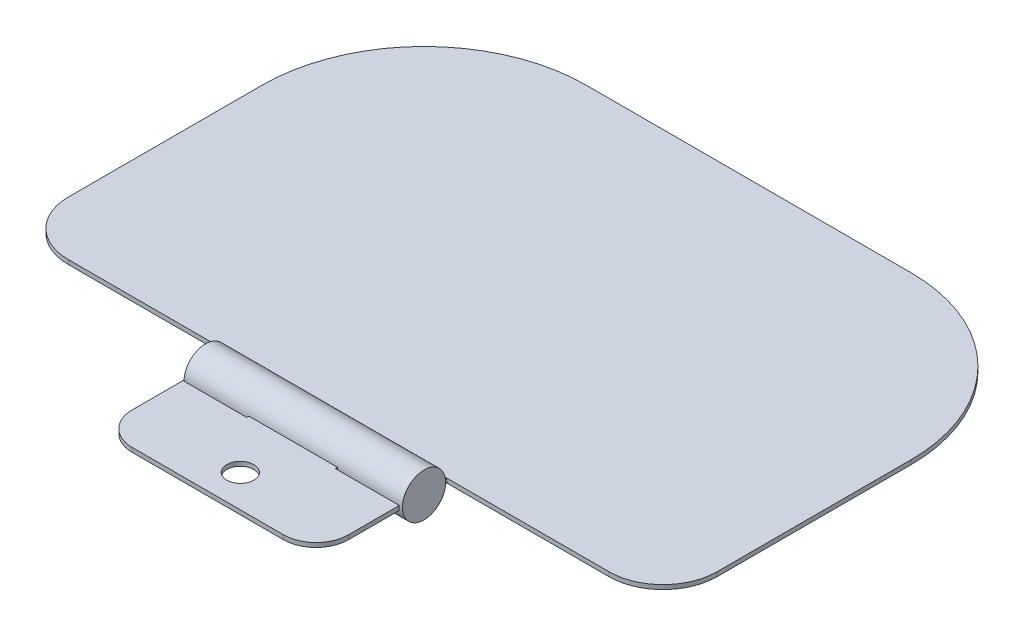
ISO-10303-21;
HEADER;
FILE_DESCRIPTION(('STEP AP214'),'2;1');
FILE_NAME('part.step','',(''),(''),'','','');
FILE_SCHEMA(('AUTOMOTIVE_DESIGN { 1 0 10303 214 1 1 1 1 }'));
ENDSEC;
DATA;
#1=APPLICATION_CONTEXT('core data for automotive mechanical design processes');
#2=APPLICATION_PROTOCOL_DEFINITION('international standard','automotive_design',2000,#1);
#3=PRODUCT_CONTEXT('',#1,'mechanical');
#4=PRODUCT('Part','Part','',(#3));
#5=PRODUCT_RELATED_PRODUCT_CATEGORY('part','',(#4));
#6=PRODUCT_DEFINITION_FORMATION('','',#4);
#7=PRODUCT_DEFINITION_CONTEXT('part definition',#1,'design');
#8=PRODUCT_DEFINITION('design','',#6,#7);
#9=PRODUCT_DEFINITION_SHAPE('','',#8);
#10=(LENGTH_UNIT() NAMED_UNIT(*) SI_UNIT(.MILLI.,.METRE.));
#11=(NAMED_UNIT(*) PLANE_ANGLE_UNIT() SI_UNIT($,.RADIAN.));
#12=(NAMED_UNIT(*) SI_UNIT($,.STERADIAN.) SOLID_ANGLE_UNIT());
#13=UNCERTAINTY_MEASURE_WITH_UNIT(LENGTH_MEASURE(1.E-05),#10,'distance_accuracy_value','');
#14=(GEOMETRIC_REPRESENTATION_CONTEXT(3) GLOBAL_UNCERTAINTY_ASSIGNED_CONTEXT((#13)) GLOBAL_UNIT_ASSIGNED_CONTEXT((#10,
#11,#12)) REPRESENTATION_CONTEXT('',''));
#15=CARTESIAN_POINT('',(0.,0.,0.));
#16=DIRECTION('',(0.,0.,1.));
#17=DIRECTION('',(1.,0.,0.));
#18=AXIS2_PLACEMENT_3D('',#15,#16,#17);
#19=CARTESIAN_POINT('',(11.2087164876528,-0.2,-37.576059538161));
#20=DIRECTION('',(1.,0.,0.));
#21=DIRECTION('',(0.,0.,-1.));
#22=AXIS2_PLACEMENT_3D('',#19,#20,#21);
#23=PLANE('',#22);
#24=CARTESIAN_POINT('',(11.2087164876528,0.,-35.376059538161));
#25=DIRECTION('',(1.,0.,0.));
#26=DIRECTION('',(0.,0.,-1.));
#27=AXIS2_PLACEMENT_3D('',#24,#25,#26);
#28=CIRCLE('',#27,2.2);
#29=CARTESIAN_POINT('',(11.2087164876528,0.,-37.576059538161));
#30=VERTEX_POINT('',#29);
#31=CARTESIAN_POINT('',(11.2087164876528,0.2,-37.5669497681817));
#32=VERTEX_POINT('',#31);
#33=EDGE_CURVE('E39',#30,#32,#28,.T.);
#34=ORIENTED_EDGE('',*,*,#33,.F.);
#35=DIRECTION('',(0.,1.,0.));
#36=VECTOR('',#35,1.);
#37=CARTESIAN_POINT('',(11.2087164876528,-0.2,-37.576059538161));
#38=LINE('',#37,#36);
#39=CARTESIAN_POINT('',(11.2087164876528,0.2,-37.576059538161));
#40=VERTEX_POINT('',#39);
#41=EDGE_CURVE('E261',#30,#40,#38,.T.);
#42=ORIENTED_EDGE('',*,*,#41,.T.);
#43=DIRECTION('',(0.,0.,-1.));
#44=VECTOR('',#43,1.);
#45=CARTESIAN_POINT('',(11.2087164876528,0.2,-37.576059538161));
#46=LINE('',#45,#44);
#47=EDGE_CURVE('E257',#32,#40,#46,.T.);
#48=ORIENTED_EDGE('',*,*,#47,.F.);
#49=EDGE_LOOP('',(#34,#42,#48));
#50=FACE_BOUND('',#49,.T.);
#51=ADVANCED_FACE('F31',(#50),#23,.T.);
#52=CARTESIAN_POINT('',(-8.79128351234723,-0.2,-37.576059538161));
#53=DIRECTION('',(-1.,0.,0.));
#54=DIRECTION('',(0.,0.,1.));
#55=AXIS2_PLACEMENT_3D('',#52,#53,#54);
#56=PLANE('',#55);
#57=CARTESIAN_POINT('',(-8.79128351234723,0.,-35.376059538161));
#58=DIRECTION('',(-1.,0.,0.));
#59=DIRECTION('',(0.,0.,1.));
#60=AXIS2_PLACEMENT_3D('',#57,#58,#59);
#61=CIRCLE('',#60,2.2);
#62=CARTESIAN_POINT('',(-8.79128351234723,0.2,-37.5669497681817));
#63=VERTEX_POINT('',#62);
#64=CARTESIAN_POINT('',(-8.79128351234723,0.,-37.576059538161));
#65=VERTEX_POINT('',#64);
#66=EDGE_CURVE('E245',#63,#65,#61,.T.);
#67=ORIENTED_EDGE('',*,*,#66,.F.);
#68=DIRECTION('',(0.,0.,1.));
#69=VECTOR('',#68,1.);
#70=CARTESIAN_POINT('',(-8.79128351234723,0.2,-37.576059538161));
#71=LINE('',#70,#69);
#72=CARTESIAN_POINT('',(-8.79128351234723,0.2,-37.576059538161));
#73=VERTEX_POINT('',#72);
#74=EDGE_CURVE('E381',#73,#63,#71,.T.);
#75=ORIENTED_EDGE('',*,*,#74,.F.);
#76=DIRECTION('',(0.,1.,0.));
#77=VECTOR('',#76,1.);
#78=CARTESIAN_POINT('',(-8.79128351234723,-0.2,-37.576059538161));
#79=LINE('',#78,#77);
#80=EDGE_CURVE('E360',#65,#73,#79,.T.);
#81=ORIENTED_EDGE('',*,*,#80,.F.);
#82=EDGE_LOOP('',(#67,#75,#81));
#83=FACE_BOUND('',#82,.T.);
#84=ADVANCED_FACE('F478',(#83),#56,.T.);
#85=CARTESIAN_POINT('',(11.2087164876528,0.,-35.376059538161));
#86=DIRECTION('',(1.,0.,0.));
#87=DIRECTION('',(0.,0.,-1.));
#88=AXIS2_PLACEMENT_3D('',#85,#86,#87);
#89=CIRCLE('',#88,2.2);
#90=CARTESIAN_POINT('',(11.2087164876528,0.2,-33.1851693081404));
#91=VERTEX_POINT('',#90);
#92=CARTESIAN_POINT('',(11.2087164876528,-0.2,-33.1851693081404));
#93=VERTEX_POINT('',#92);
#94=EDGE_CURVE('E414',#91,#93,#89,.T.);
#95=ORIENTED_EDGE('',*,*,#94,.F.);
#96=CARTESIAN_POINT('',(11.2087164876528,0.2,-28.4856050421243));
#97=VERTEX_POINT('',#96);
#98=EDGE_CURVE('E263',#97,#91,#46,.T.);
#99=ORIENTED_EDGE('',*,*,#98,.F.);
#100=DIRECTION('',(0.,1.,0.));
#101=VECTOR('',#100,1.);
#102=CARTESIAN_POINT('',(11.2087164876528,-0.2,-28.4856050421243));
#103=LINE('',#102,#101);
#104=CARTESIAN_POINT('',(11.2087164876528,-0.2,-28.4856050421243));
#105=VERTEX_POINT('',#104);
#106=EDGE_CURVE('E350',#105,#97,#103,.T.);
#107=ORIENTED_EDGE('',*,*,#106,.F.);
#108=DIRECTION('',(0.,0.,-1.));
#109=VECTOR('',#108,1.);
#110=CARTESIAN_POINT('',(11.2087164876528,-0.2,-37.576059538161));
#111=LINE('',#110,#109);
#112=EDGE_CURVE('E314',#105,#93,#111,.T.);
#113=ORIENTED_EDGE('',*,*,#112,.T.);
#114=EDGE_LOOP('',(#95,#99,#107,#113));
#115=FACE_BOUND('',#114,.T.);
#116=ADVANCED_FACE('F401',(#115),#23,.T.);
#117=CARTESIAN_POINT('',(-23.7912835123472,-0.2,-42.576059538161));
#118=DIRECTION('',(0.,1.,0.));
#119=DIRECTION('',(0.,0.,1.));
#120=AXIS2_PLACEMENT_3D('',#117,#118,#119);
#121=PLANE('',#120);
#122=CARTESIAN_POINT('',(1.20871648765277,-0.2,-28.4856050421243));
#123=DIRECTION('',(0.,1.,0.));
#124=DIRECTION('',(0.,0.,1.));
#125=AXIS2_PLACEMENT_3D('',#122,#123,#124);
#126=CIRCLE('',#125,1.25);
#127=CARTESIAN_POINT('',(1.20871648765277,-0.2,-27.2356050421243));
#128=VERTEX_POINT('',#127);
#129=EDGE_CURVE('E292',#128,#128,#126,.T.);
#130=ORIENTED_EDGE('',*,*,#129,.T.);
#131=EDGE_LOOP('',(#130));
#132=FACE_BOUND('',#131,.T.);
#133=DIRECTION('',(0.,0.,-1.));
#134=VECTOR('',#133,1.);
#135=CARTESIAN_POINT('',(5.30871648765277,-0.2,-42.576059538161));
#136=LINE('',#135,#134);
#137=CARTESIAN_POINT('',(5.30871648765277,-0.2,-33.1851693081404));
#138=VERTEX_POINT('',#137);
#139=CARTESIAN_POINT('',(5.30871648765277,-0.2,-33.3860846639478));
#140=VERTEX_POINT('',#139);
#141=EDGE_CURVE('E409',#138,#140,#136,.T.);
#142=ORIENTED_EDGE('',*,*,#141,.F.);
#143=DIRECTION('',(1.,0.,0.));
#144=VECTOR('',#143,1.);
#145=CARTESIAN_POINT('',(5.30871648765277,-0.2,-33.1851693081404));
#146=LINE('',#145,#144);
#147=EDGE_CURVE('E407',#138,#93,#146,.T.);
#148=ORIENTED_EDGE('',*,*,#147,.T.);
#149=ORIENTED_EDGE('',*,*,#112,.F.);
#150=CARTESIAN_POINT('',(8.20871648765277,-0.2,-28.4856050421243));
#151=DIRECTION('',(0.,1.,0.));
#152=DIRECTION('',(0.,0.,1.));
#153=AXIS2_PLACEMENT_3D('',#150,#151,#152);
#154=CIRCLE('',#153,3.);
#155=CARTESIAN_POINT('',(8.20871648765277,-0.2,-25.4856050421243));
#156=VERTEX_POINT('',#155);
#157=EDGE_CURVE('E310',#156,#105,#154,.T.);
#158=ORIENTED_EDGE('',*,*,#157,.F.);
#159=DIRECTION('',(1.,0.,0.));
#160=VECTOR('',#159,1.);
#161=CARTESIAN_POINT('',(-5.79128351234723,-0.2,-25.4856050421243));
#162=LINE('',#161,#160);
#163=CARTESIAN_POINT('',(-5.79128351234723,-0.2,-25.4856050421243));
#164=VERTEX_POINT('',#163);
#165=EDGE_CURVE('E307',#164,#156,#162,.T.);
#166=ORIENTED_EDGE('',*,*,#165,.F.);
#167=CARTESIAN_POINT('',(-5.79128351234723,-0.2,-28.4856050421243));
#168=DIRECTION('',(0.,1.,0.));
#169=DIRECTION('',(0.,0.,1.));
#170=AXIS2_PLACEMENT_3D('',#167,#168,#169);
#171=CIRCLE('',#170,3.);
#172=CARTESIAN_POINT('',(-8.79128351234723,-0.2,-28.4856050421243));
#173=VERTEX_POINT('',#172);
#174=EDGE_CURVE('E304',#173,#164,#171,.T.);
#175=ORIENTED_EDGE('',*,*,#174,.F.);
#176=DIRECTION('',(0.,0.,1.));
#177=VECTOR('',#176,1.);
#178=CARTESIAN_POINT('',(-8.79128351234723,-0.2,-37.576059538161));
#179=LINE('',#178,#177);
#180=CARTESIAN_POINT('',(-8.79128351234723,-0.2,-33.1851693081404));
#181=VERTEX_POINT('',#180);
#182=EDGE_CURVE('E300',#181,#173,#179,.T.);
#183=ORIENTED_EDGE('',*,*,#182,.F.);
#184=DIRECTION('',(-1.,0.,0.));
#185=VECTOR('',#184,1.);
#186=CARTESIAN_POINT('',(-2.89128351234723,-0.2,-33.1851693081404));
#187=LINE('',#186,#185);
#188=CARTESIAN_POINT('',(-2.89128351234723,-0.2,-33.1851693081404));
#189=VERTEX_POINT('',#188);
#190=EDGE_CURVE('E442',#181,#189,#187,.F.);
#191=ORIENTED_EDGE('',*,*,#190,.T.);
#192=DIRECTION('',(0.,0.,1.));
#193=VECTOR('',#192,1.);
#194=CARTESIAN_POINT('',(-2.89128351234723,-0.2,-42.576059538161));
#195=LINE('',#194,#193);
#196=CARTESIAN_POINT('',(-2.89128351234723,-0.2,-33.3860846639478));
#197=VERTEX_POINT('',#196);
#198=EDGE_CURVE('E451',#197,#189,#195,.T.);
#199=ORIENTED_EDGE('',*,*,#198,.F.);
#200=DIRECTION('',(1.,0.,0.));
#201=VECTOR('',#200,1.);
#202=CARTESIAN_POINT('',(-8.89128351234723,-0.2,-33.3860846639478));
#203=LINE('',#202,#201);
#204=EDGE_CURVE('E377',#197,#140,#203,.T.);
#205=ORIENTED_EDGE('',*,*,#204,.T.);
#206=EDGE_LOOP('',(#142,#148,#149,#158,#166,#175,#183,#191,#199,#205));
#207=FACE_BOUND('',#206,.T.);
#208=ADVANCED_FACE('F405',(#132,#207),#121,.F.);
#209=CARTESIAN_POINT('',(-23.7912835123472,0.2,-42.576059538161));
#210=DIRECTION('',(0.,1.,0.));
#211=DIRECTION('',(0.,0.,1.));
#212=AXIS2_PLACEMENT_3D('',#209,#210,#211);
#213=PLANE('',#212);
#214=DIRECTION('',(1.,0.,0.));
#215=VECTOR('',#214,1.);
#216=CARTESIAN_POINT('',(5.30871648765277,0.2,-33.1851693081404));
#217=LINE('',#216,#215);
#218=CARTESIAN_POINT('',(5.30871648765277,0.2,-33.1851693081404));
#219=VERTEX_POINT('',#218);
#220=EDGE_CURVE('E418',#219,#91,#217,.T.);
#221=ORIENTED_EDGE('',*,*,#220,.F.);
#222=DIRECTION('',(0.,0.,-1.));
#223=VECTOR('',#222,1.);
#224=CARTESIAN_POINT('',(5.30871648765277,0.2,-42.576059538161));
#225=LINE('',#224,#223);
#226=CARTESIAN_POINT('',(5.30871648765277,0.2,-33.3860846639478));
#227=VERTEX_POINT('',#226);
#228=EDGE_CURVE('E416',#219,#227,#225,.T.);
#229=ORIENTED_EDGE('',*,*,#228,.T.);
#230=DIRECTION('',(1.,0.,0.));
#231=VECTOR('',#230,1.);
#232=CARTESIAN_POINT('',(-8.89128351234723,0.2,-33.3860846639478));
#233=LINE('',#232,#231);
#234=CARTESIAN_POINT('',(-2.89128351234723,0.2,-33.3860846639478));
#235=VERTEX_POINT('',#234);
#236=EDGE_CURVE('E234',#235,#227,#233,.T.);
#237=ORIENTED_EDGE('',*,*,#236,.F.);
#238=DIRECTION('',(0.,0.,1.));
#239=VECTOR('',#238,1.);
#240=CARTESIAN_POINT('',(-2.89128351234723,0.2,-42.576059538161));
#241=LINE('',#240,#239);
#242=CARTESIAN_POINT('',(-2.89128351234723,0.2,-33.1851693081404));
#243=VERTEX_POINT('',#242);
#244=EDGE_CURVE('E448',#235,#243,#241,.T.);
#245=ORIENTED_EDGE('',*,*,#244,.T.);
#246=DIRECTION('',(-1.,0.,0.));
#247=VECTOR('',#246,1.);
#248=CARTESIAN_POINT('',(-2.89128351234723,0.2,-33.1851693081404));
#249=LINE('',#248,#247);
#250=CARTESIAN_POINT('',(-8.79128351234723,0.2,-33.1851693081404));
#251=VERTEX_POINT('',#250);
#252=EDGE_CURVE('E440',#251,#243,#249,.F.);
#253=ORIENTED_EDGE('',*,*,#252,.F.);
#254=CARTESIAN_POINT('',(-8.79128351234723,0.2,-28.4856050421243));
#255=VERTEX_POINT('',#254);
#256=EDGE_CURVE('E372',#251,#255,#71,.T.);
#257=ORIENTED_EDGE('',*,*,#256,.T.);
#258=CARTESIAN_POINT('',(-5.79128351234723,0.2,-28.4856050421243));
#259=DIRECTION('',(0.,1.,0.));
#260=DIRECTION('',(0.,0.,1.));
#261=AXIS2_PLACEMENT_3D('',#258,#259,#260);
#262=CIRCLE('',#261,3.);
#263=CARTESIAN_POINT('',(-5.79128351234723,0.2,-25.4856050421243));
#264=VERTEX_POINT('',#263);
#265=EDGE_CURVE('E383',#255,#264,#262,.T.);
#266=ORIENTED_EDGE('',*,*,#265,.T.);
#267=DIRECTION('',(1.,0.,0.));
#268=VECTOR('',#267,1.);
#269=CARTESIAN_POINT('',(-5.79128351234723,0.2,-25.4856050421243));
#270=LINE('',#269,#268);
#271=CARTESIAN_POINT('',(8.20871648765277,0.2,-25.4856050421243));
#272=VERTEX_POINT('',#271);
#273=EDGE_CURVE('E269',#264,#272,#270,.T.);
#274=ORIENTED_EDGE('',*,*,#273,.T.);
#275=CARTESIAN_POINT('',(8.20871648765277,0.2,-28.4856050421243));
#276=DIRECTION('',(0.,1.,0.));
#277=DIRECTION('',(0.,0.,1.));
#278=AXIS2_PLACEMENT_3D('',#275,#276,#277);
#279=CIRCLE('',#278,3.);
#280=EDGE_CURVE('E264',#272,#97,#279,.T.);
#281=ORIENTED_EDGE('',*,*,#280,.T.);
#282=ORIENTED_EDGE('',*,*,#98,.T.);
#283=EDGE_LOOP('',(#221,#229,#237,#245,#253,#257,#266,#274,#281,#282));
#284=FACE_BOUND('',#283,.T.);
#285=CARTESIAN_POINT('',(1.20871648765277,0.2,-28.4856050421243));
#286=DIRECTION('',(0.,1.,0.));
#287=DIRECTION('',(0.,0.,1.));
#288=AXIS2_PLACEMENT_3D('',#285,#286,#287);
#289=CIRCLE('',#288,1.25);
#290=CARTESIAN_POINT('',(1.20871648765277,0.2,-27.2356050421243));
#291=VERTEX_POINT('',#290);
#292=EDGE_CURVE('E374',#291,#291,#289,.T.);
#293=ORIENTED_EDGE('',*,*,#292,.F.);
#294=EDGE_LOOP('',(#293));
#295=FACE_BOUND('',#294,.T.);
#296=ADVANCED_FACE('F390',(#284,#295),#213,.T.);
#297=CARTESIAN_POINT('',(8.20871648765277,-0.2,-28.4856050421243));
#298=DIRECTION('',(0.,1.,0.));
#299=DIRECTION('',(0.,0.,1.));
#300=AXIS2_PLACEMENT_3D('',#297,#298,#299);
#301=CYLINDRICAL_SURFACE('',#300,3.);
#302=ORIENTED_EDGE('',*,*,#106,.T.);
#303=ORIENTED_EDGE('',*,*,#280,.F.);
#304=DIRECTION('',(0.,1.,0.));
#305=VECTOR('',#304,1.);
#306=CARTESIAN_POINT('',(8.20871648765277,-0.2,-25.4856050421243));
#307=LINE('',#306,#305);
#308=EDGE_CURVE('E352',#156,#272,#307,.T.);
#309=ORIENTED_EDGE('',*,*,#308,.F.);
#310=ORIENTED_EDGE('',*,*,#157,.T.);
#311=EDGE_LOOP('',(#302,#303,#309,#310));
#312=FACE_BOUND('',#311,.T.);
#313=ADVANCED_FACE('F396',(#312),#301,.T.);
#314=CARTESIAN_POINT('',(-5.79128351234723,-0.2,-25.4856050421243));
#315=DIRECTION('',(0.,0.,1.));
#316=DIRECTION('',(1.,0.,0.));
#317=AXIS2_PLACEMENT_3D('',#314,#315,#316);
#318=PLANE('',#317);
#319=ORIENTED_EDGE('',*,*,#308,.T.);
#320=ORIENTED_EDGE('',*,*,#273,.F.);
#321=DIRECTION('',(0.,1.,0.));
#322=VECTOR('',#321,1.);
#323=CARTESIAN_POINT('',(-5.79128351234723,-0.2,-25.4856050421243));
#324=LINE('',#323,#322);
#325=EDGE_CURVE('E354',#164,#264,#324,.T.);
#326=ORIENTED_EDGE('',*,*,#325,.F.);
#327=ORIENTED_EDGE('',*,*,#165,.T.);
#328=EDGE_LOOP('',(#319,#320,#326,#327));
#329=FACE_BOUND('',#328,.T.);
#330=ADVANCED_FACE('F601',(#329),#318,.T.);
#331=CARTESIAN_POINT('',(-5.79128351234723,-0.2,-28.4856050421243));
#332=DIRECTION('',(0.,1.,0.));
#333=DIRECTION('',(0.,0.,1.));
#334=AXIS2_PLACEMENT_3D('',#331,#332,#333);
#335=CYLINDRICAL_SURFACE('',#334,3.);
#336=ORIENTED_EDGE('',*,*,#325,.T.);
#337=ORIENTED_EDGE('',*,*,#265,.F.);
#338=DIRECTION('',(0.,1.,0.));
#339=VECTOR('',#338,1.);
#340=CARTESIAN_POINT('',(-8.79128351234723,-0.2,-28.4856050421243));
#341=LINE('',#340,#339);
#342=EDGE_CURVE('E356',#173,#255,#341,.T.);
#343=ORIENTED_EDGE('',*,*,#342,.F.);
#344=ORIENTED_EDGE('',*,*,#174,.T.);
#345=EDGE_LOOP('',(#336,#337,#343,#344));
#346=FACE_BOUND('',#345,.T.);
#347=ADVANCED_FACE('F574',(#346),#335,.T.);
#348=CARTESIAN_POINT('',(-8.79128351234723,0.,-35.376059538161));
#349=DIRECTION('',(-1.,0.,0.));
#350=DIRECTION('',(0.,0.,1.));
#351=AXIS2_PLACEMENT_3D('',#348,#349,#350);
#352=CIRCLE('',#351,2.2);
#353=EDGE_CURVE('E438',#181,#251,#352,.T.);
#354=ORIENTED_EDGE('',*,*,#353,.F.);
#355=ORIENTED_EDGE('',*,*,#182,.T.);
#356=ORIENTED_EDGE('',*,*,#342,.T.);
#357=ORIENTED_EDGE('',*,*,#256,.F.);
#358=EDGE_LOOP('',(#354,#355,#356,#357));
#359=FACE_BOUND('',#358,.T.);
#360=ADVANCED_FACE('F487',(#359),#56,.T.);
#361=CARTESIAN_POINT('',(1.20871648765277,-0.2,-28.4856050421243));
#362=DIRECTION('',(0.,1.,0.));
#363=DIRECTION('',(0.,0.,1.));
#364=AXIS2_PLACEMENT_3D('',#361,#362,#363);
#365=CYLINDRICAL_SURFACE('',#364,1.25);
#366=ORIENTED_EDGE('',*,*,#129,.F.);
#367=EDGE_LOOP('',(#366));
#368=FACE_BOUND('',#367,.T.);
#369=ORIENTED_EDGE('',*,*,#292,.T.);
#370=EDGE_LOOP('',(#369));
#371=FACE_BOUND('',#370,.T.);
#372=ADVANCED_FACE('F564',(#368,#371),#365,.F.);
#373=CARTESIAN_POINT('',(-8.89128351234723,0.,-35.376059538161));
#374=DIRECTION('',(1.,0.,0.));
#375=DIRECTION('',(0.,0.,-1.));
#376=AXIS2_PLACEMENT_3D('',#373,#374,#375);
#377=CYLINDRICAL_SURFACE('',#376,2.);
#378=CARTESIAN_POINT('',(5.30871648765277,0.,-35.376059538161));
#379=DIRECTION('',(1.,0.,0.));
#380=DIRECTION('',(0.,0.,-1.));
#381=AXIS2_PLACEMENT_3D('',#378,#379,#380);
#382=CIRCLE('',#381,2.);
#383=EDGE_CURVE('E228',#227,#140,#382,.T.);
#384=ORIENTED_EDGE('',*,*,#383,.T.);
#385=ORIENTED_EDGE('',*,*,#204,.F.);
#386=CARTESIAN_POINT('',(-2.89128351234723,0.,-35.376059538161));
#387=DIRECTION('',(-1.,0.,0.));
#388=DIRECTION('',(0.,0.,1.));
#389=AXIS2_PLACEMENT_3D('',#386,#387,#388);
#390=CIRCLE('',#389,2.);
#391=EDGE_CURVE('E425',#197,#235,#390,.T.);
#392=ORIENTED_EDGE('',*,*,#391,.T.);
#393=ORIENTED_EDGE('',*,*,#236,.T.);
#394=EDGE_LOOP('',(#384,#385,#392,#393));
#395=FACE_BOUND('',#394,.T.);
#396=DIRECTION('',(1.,0.,0.));
#397=VECTOR('',#396,1.);
#398=CARTESIAN_POINT('',(-8.89128351234723,-0.2,-37.3660344123743));
#399=LINE('',#398,#397);
#400=CARTESIAN_POINT('',(5.30871648765277,-0.2,-37.3660344123743));
#401=VERTEX_POINT('',#400);
#402=CARTESIAN_POINT('',(-2.89128351234723,-0.2,-37.3660344123743));
#403=VERTEX_POINT('',#402);
#404=EDGE_CURVE('E227',#401,#403,#399,.F.);
#405=ORIENTED_EDGE('',*,*,#404,.F.);
#406=CARTESIAN_POINT('',(5.30871648765277,0.2,-37.3660344123743));
#407=VERTEX_POINT('',#406);
#408=EDGE_CURVE('E213',#401,#407,#382,.T.);
#409=ORIENTED_EDGE('',*,*,#408,.T.);
#410=DIRECTION('',(1.,0.,0.));
#411=VECTOR('',#410,1.);
#412=CARTESIAN_POINT('',(-8.89128351234723,0.2,-37.3660344123743));
#413=LINE('',#412,#411);
#414=CARTESIAN_POINT('',(-2.89128351234723,0.2,-37.3660344123743));
#415=VERTEX_POINT('',#414);
#416=EDGE_CURVE('E225',#407,#415,#413,.F.);
#417=ORIENTED_EDGE('',*,*,#416,.T.);
#418=EDGE_CURVE('E428',#415,#403,#390,.T.);
#419=ORIENTED_EDGE('',*,*,#418,.T.);
#420=EDGE_LOOP('',(#405,#409,#417,#419));
#421=FACE_BOUND('',#420,.T.);
#422=CARTESIAN_POINT('',(11.3087164876528,0.,-35.376059538161));
#423=DIRECTION('',(1.,0.,0.));
#424=DIRECTION('',(0.,0.,-1.));
#425=AXIS2_PLACEMENT_3D('',#422,#423,#424);
#426=CIRCLE('',#425,2.);
#427=CARTESIAN_POINT('',(11.3087164876528,0.,-37.376059538161));
#428=VERTEX_POINT('',#427);
#429=EDGE_CURVE('E453',#428,#428,#426,.T.);
#430=ORIENTED_EDGE('',*,*,#429,.F.);
#431=EDGE_LOOP('',(#430));
#432=FACE_BOUND('',#431,.T.);
#433=CARTESIAN_POINT('',(-8.89128351234723,0.,-35.376059538161));
#434=DIRECTION('',(1.,0.,0.));
#435=DIRECTION('',(0.,0.,-1.));
#436=AXIS2_PLACEMENT_3D('',#433,#434,#435);
#437=CIRCLE('',#436,2.);
#438=CARTESIAN_POINT('',(-8.89128351234723,0.,-37.376059538161));
#439=VERTEX_POINT('',#438);
#440=EDGE_CURVE('E456',#439,#439,#437,.T.);
#441=ORIENTED_EDGE('',*,*,#440,.T.);
#442=EDGE_LOOP('',(#441));
#443=FACE_BOUND('',#442,.T.);
#444=ADVANCED_FACE('F222',(#395,#421,#432,#443),#377,.T.);
#445=CARTESIAN_POINT('',(-8.89128351234723,0.,-35.376059538161));
#446=DIRECTION('',(1.,0.,0.));
#447=DIRECTION('',(0.,0.,-1.));
#448=AXIS2_PLACEMENT_3D('',#445,#446,#447);
#449=PLANE('',#448);
#450=ORIENTED_EDGE('',*,*,#440,.F.);
#451=EDGE_LOOP('',(#450));
#452=FACE_BOUND('',#451,.T.);
#453=ADVANCED_FACE('F572',(#452),#449,.F.);
#454=CARTESIAN_POINT('',(11.3087164876528,0.,-35.376059538161));
#455=DIRECTION('',(1.,0.,0.));
#456=DIRECTION('',(0.,0.,-1.));
#457=AXIS2_PLACEMENT_3D('',#454,#455,#456);
#458=PLANE('',#457);
#459=ORIENTED_EDGE('',*,*,#429,.T.);
#460=EDGE_LOOP('',(#459));
#461=FACE_BOUND('',#460,.T.);
#462=ADVANCED_FACE('F579',(#461),#458,.T.);
#463=CARTESIAN_POINT('',(-23.7912835123472,-0.2,-37.576059538161));
#464=DIRECTION('',(0.,0.,1.));
#465=DIRECTION('',(1.,0.,0.));
#466=AXIS2_PLACEMENT_3D('',#463,#464,#465);
#467=PLANE('',#466);
#468=CARTESIAN_POINT('',(-8.79128351234723,-0.2,-37.576059538161));
#469=VERTEX_POINT('',#468);
#470=EDGE_CURVE('E358',#469,#65,#79,.T.);
#471=ORIENTED_EDGE('',*,*,#470,.T.);
#472=ORIENTED_EDGE('',*,*,#80,.T.);
#473=DIRECTION('',(1.,0.,0.));
#474=VECTOR('',#473,1.);
#475=CARTESIAN_POINT('',(-23.7912835123472,0.2,-37.576059538161));
#476=LINE('',#475,#474);
#477=CARTESIAN_POINT('',(-23.7912835123472,0.2,-37.576059538161));
#478=VERTEX_POINT('',#477);
#479=EDGE_CURVE('E368',#478,#73,#476,.T.);
#480=ORIENTED_EDGE('',*,*,#479,.F.);
#481=DIRECTION('',(0.,1.,0.));
#482=VECTOR('',#481,1.);
#483=CARTESIAN_POINT('',(-23.7912835123472,-0.2,-37.576059538161));
#484=LINE('',#483,#482);
#485=CARTESIAN_POINT('',(-23.7912835123472,-0.2,-37.576059538161));
#486=VERTEX_POINT('',#485);
#487=EDGE_CURVE('E241',#486,#478,#484,.T.);
#488=ORIENTED_EDGE('',*,*,#487,.F.);
#489=DIRECTION('',(1.,0.,0.));
#490=VECTOR('',#489,1.);
#491=CARTESIAN_POINT('',(-23.7912835123472,-0.2,-37.576059538161));
#492=LINE('',#491,#490);
#493=EDGE_CURVE('E297',#486,#469,#492,.T.);
#494=ORIENTED_EDGE('',*,*,#493,.T.);
#495=EDGE_LOOP('',(#471,#472,#480,#488,#494));
#496=FACE_BOUND('',#495,.T.);
#497=ADVANCED_FACE('F369',(#496),#467,.T.);
#498=CARTESIAN_POINT('',(-23.7912835123472,-0.2,-42.576059538161));
#499=DIRECTION('',(0.,1.,0.));
#500=DIRECTION('',(0.,0.,1.));
#501=AXIS2_PLACEMENT_3D('',#498,#499,#500);
#502=CYLINDRICAL_SURFACE('',#501,4.99999999999999);
#503=ORIENTED_EDGE('',*,*,#487,.T.);
#504=CARTESIAN_POINT('',(-23.7912835123472,0.2,-42.576059538161));
#505=DIRECTION('',(0.,1.,0.));
#506=DIRECTION('',(0.,0.,1.));
#507=AXIS2_PLACEMENT_3D('',#504,#505,#506);
#508=CIRCLE('',#507,4.99999999999999);
#509=CARTESIAN_POINT('',(-28.7912835123472,0.2,-42.576059538161));
#510=VERTEX_POINT('',#509);
#511=EDGE_CURVE('E366',#510,#478,#508,.T.);
#512=ORIENTED_EDGE('',*,*,#511,.F.);
#513=DIRECTION('',(0.,1.,0.));
#514=VECTOR('',#513,1.);
#515=CARTESIAN_POINT('',(-28.7912835123472,-0.2,-42.576059538161));
#516=LINE('',#515,#514);
#517=CARTESIAN_POINT('',(-28.7912835123472,-0.2,-42.576059538161));
#518=VERTEX_POINT('',#517);
#519=EDGE_CURVE('E46',#518,#510,#516,.T.);
#520=ORIENTED_EDGE('',*,*,#519,.F.);
#521=CARTESIAN_POINT('',(-23.7912835123472,-0.2,-42.576059538161));
#522=DIRECTION('',(0.,1.,0.));
#523=DIRECTION('',(0.,0.,1.));
#524=AXIS2_PLACEMENT_3D('',#521,#522,#523);
#525=CIRCLE('',#524,4.99999999999999);
#526=EDGE_CURVE('E295',#518,#486,#525,.T.);
#527=ORIENTED_EDGE('',*,*,#526,.T.);
#528=EDGE_LOOP('',(#503,#512,#520,#527));
#529=FACE_BOUND('',#528,.T.);
#530=ADVANCED_FACE('F33',(#529),#502,.T.);
#531=CARTESIAN_POINT('',(-28.7912835123472,-0.2,-60.4856050421244));
#532=DIRECTION('',(-1.,0.,0.));
#533=DIRECTION('',(0.,0.,1.));
#534=AXIS2_PLACEMENT_3D('',#531,#532,#533);
#535=PLANE('',#534);
#536=ORIENTED_EDGE('',*,*,#519,.T.);
#537=DIRECTION('',(0.,0.,1.));
#538=VECTOR('',#537,1.);
#539=CARTESIAN_POINT('',(-28.7912835123472,0.2,-60.4856050421244));
#540=LINE('',#539,#538);
#541=CARTESIAN_POINT('',(-28.7912835123472,0.2,-60.4856050421244));
#542=VERTEX_POINT('',#541);
#543=EDGE_CURVE('E289',#542,#510,#540,.T.);
#544=ORIENTED_EDGE('',*,*,#543,.F.);
#545=DIRECTION('',(0.,1.,0.));
#546=VECTOR('',#545,1.);
#547=CARTESIAN_POINT('',(-28.7912835123472,-0.2,-60.4856050421244));
#548=LINE('',#547,#546);
#549=CARTESIAN_POINT('',(-28.7912835123472,-0.2,-60.4856050421244));
#550=VERTEX_POINT('',#549);
#551=EDGE_CURVE('E54',#550,#542,#548,.T.);
#552=ORIENTED_EDGE('',*,*,#551,.F.);
#553=DIRECTION('',(0.,0.,1.));
#554=VECTOR('',#553,1.);
#555=CARTESIAN_POINT('',(-28.7912835123472,-0.2,-60.4856050421244));
#556=LINE('',#555,#554);
#557=EDGE_CURVE('E334',#550,#518,#556,.T.);
#558=ORIENTED_EDGE('',*,*,#557,.T.);
#559=EDGE_LOOP('',(#536,#544,#552,#558));
#560=FACE_BOUND('',#559,.T.);
#561=ADVANCED_FACE('F531',(#560),#535,.T.);
#562=CARTESIAN_POINT('',(-13.7958517435254,-0.2,-60.4901732733025));
#563=DIRECTION('',(0.,1.,0.));
#564=DIRECTION('',(0.,0.,1.));
#565=AXIS2_PLACEMENT_3D('',#562,#563,#564);
#566=CYLINDRICAL_SURFACE('',#565,14.9954324646583);
#567=ORIENTED_EDGE('',*,*,#551,.T.);
#568=CARTESIAN_POINT('',(-13.7958517435254,0.2,-60.4901732733025));
#569=DIRECTION('',(0.,1.,0.));
#570=DIRECTION('',(0.,0.,1.));
#571=AXIS2_PLACEMENT_3D('',#568,#569,#570);
#572=CIRCLE('',#571,14.9954324646583);
#573=CARTESIAN_POINT('',(-13.7912835123472,0.2,-75.4856050421244));
#574=VERTEX_POINT('',#573);
#575=EDGE_CURVE('E286',#574,#542,#572,.T.);
#576=ORIENTED_EDGE('',*,*,#575,.F.);
#577=DIRECTION('',(0.,1.,0.));
#578=VECTOR('',#577,1.);
#579=CARTESIAN_POINT('',(-13.7912835123472,-0.2,-75.4856050421244));
#580=LINE('',#579,#578);
#581=CARTESIAN_POINT('',(-13.7912835123472,-0.2,-75.4856050421244));
#582=VERTEX_POINT('',#581);
#583=EDGE_CURVE('E337',#582,#574,#580,.T.);
#584=ORIENTED_EDGE('',*,*,#583,.F.);
#585=CARTESIAN_POINT('',(-13.7958517435254,-0.2,-60.4901732733025));
#586=DIRECTION('',(0.,1.,0.));
#587=DIRECTION('',(0.,0.,1.));
#588=AXIS2_PLACEMENT_3D('',#585,#586,#587);
#589=CIRCLE('',#588,14.9954324646583);
#590=EDGE_CURVE('E332',#582,#550,#589,.T.);
#591=ORIENTED_EDGE('',*,*,#590,.T.);
#592=EDGE_LOOP('',(#567,#576,#584,#591));
#593=FACE_BOUND('',#592,.T.);
#594=ADVANCED_FACE('F529',(#593),#566,.T.);
#595=CARTESIAN_POINT('',(-13.7912835123472,-0.2,-75.4856050421244));
#596=DIRECTION('',(0.,0.,-1.));
#597=DIRECTION('',(-1.,0.,0.));
#598=AXIS2_PLACEMENT_3D('',#595,#596,#597);
#599=PLANE('',#598);
#600=ORIENTED_EDGE('',*,*,#583,.T.);
#601=DIRECTION('',(-1.,0.,0.));
#602=VECTOR('',#601,1.);
#603=CARTESIAN_POINT('',(-13.7912835123472,0.2,-75.4856050421244));
#604=LINE('',#603,#602);
#605=CARTESIAN_POINT('',(16.2087164876528,0.2,-75.4856050421244));
#606=VERTEX_POINT('',#605);
#607=EDGE_CURVE('E283',#606,#574,#604,.T.);
#608=ORIENTED_EDGE('',*,*,#607,.F.);
#609=DIRECTION('',(0.,1.,0.));
#610=VECTOR('',#609,1.);
#611=CARTESIAN_POINT('',(16.2087164876528,-0.2,-75.4856050421244));
#612=LINE('',#611,#610);
#613=CARTESIAN_POINT('',(16.2087164876528,-0.2,-75.4856050421244));
#614=VERTEX_POINT('',#613);
#615=EDGE_CURVE('E339',#614,#606,#612,.T.);
#616=ORIENTED_EDGE('',*,*,#615,.F.);
#617=DIRECTION('',(-1.,0.,0.));
#618=VECTOR('',#617,1.);
#619=CARTESIAN_POINT('',(-13.7912835123472,-0.2,-75.4856050421244));
#620=LINE('',#619,#618);
#621=EDGE_CURVE('E329',#614,#582,#620,.T.);
#622=ORIENTED_EDGE('',*,*,#621,.T.);
#623=EDGE_LOOP('',(#600,#608,#616,#622));
#624=FACE_BOUND('',#623,.T.);
#625=ADVANCED_FACE('F527',(#624),#599,.T.);
#626=CARTESIAN_POINT('',(16.2087164876528,-0.2,-60.4856050421244));
#627=DIRECTION('',(0.,1.,0.));
#628=DIRECTION('',(0.,0.,1.));
#629=AXIS2_PLACEMENT_3D('',#626,#627,#628);
#630=CYLINDRICAL_SURFACE('',#629,15.);
#631=ORIENTED_EDGE('',*,*,#615,.T.);
#632=CARTESIAN_POINT('',(16.2087164876528,0.2,-60.4856050421244));
#633=DIRECTION('',(0.,1.,0.));
#634=DIRECTION('',(0.,0.,1.));
#635=AXIS2_PLACEMENT_3D('',#632,#633,#634);
#636=CIRCLE('',#635,15.);
#637=CARTESIAN_POINT('',(31.2087164876528,0.2,-60.4856050421244));
#638=VERTEX_POINT('',#637);
#639=EDGE_CURVE('E280',#638,#606,#636,.T.);
#640=ORIENTED_EDGE('',*,*,#639,.F.);
#641=DIRECTION('',(0.,1.,0.));
#642=VECTOR('',#641,1.);
#643=CARTESIAN_POINT('',(31.2087164876528,-0.2,-60.4856050421244));
#644=LINE('',#643,#642);
#645=CARTESIAN_POINT('',(31.2087164876528,-0.2,-60.4856050421244));
#646=VERTEX_POINT('',#645);
#647=EDGE_CURVE('E341',#646,#638,#644,.T.);
#648=ORIENTED_EDGE('',*,*,#647,.F.);
#649=CARTESIAN_POINT('',(16.2087164876528,-0.2,-60.4856050421244));
#650=DIRECTION('',(0.,1.,0.));
#651=DIRECTION('',(0.,0.,1.));
#652=AXIS2_PLACEMENT_3D('',#649,#650,#651);
#653=CIRCLE('',#652,15.);
#654=EDGE_CURVE('E326',#646,#614,#653,.T.);
#655=ORIENTED_EDGE('',*,*,#654,.T.);
#656=EDGE_LOOP('',(#631,#640,#648,#655));
#657=FACE_BOUND('',#656,.T.);
#658=ADVANCED_FACE('F522',(#657),#630,.T.);
#659=CARTESIAN_POINT('',(31.2087164876528,-0.2,-42.576059538161));
#660=DIRECTION('',(1.,0.,0.));
#661=DIRECTION('',(0.,0.,-1.));
#662=AXIS2_PLACEMENT_3D('',#659,#660,#661);
#663=PLANE('',#662);
#664=ORIENTED_EDGE('',*,*,#647,.T.);
#665=DIRECTION('',(0.,0.,-1.));
#666=VECTOR('',#665,1.);
#667=CARTESIAN_POINT('',(31.2087164876528,0.2,-42.576059538161));
#668=LINE('',#667,#666);
#669=CARTESIAN_POINT('',(31.2087164876528,0.2,-42.576059538161));
#670=VERTEX_POINT('',#669);
#671=EDGE_CURVE('E277',#670,#638,#668,.T.);
#672=ORIENTED_EDGE('',*,*,#671,.F.);
#673=DIRECTION('',(0.,1.,0.));
#674=VECTOR('',#673,1.);
#675=CARTESIAN_POINT('',(31.2087164876528,-0.2,-42.576059538161));
#676=LINE('',#675,#674);
#677=CARTESIAN_POINT('',(31.2087164876528,-0.2,-42.576059538161));
#678=VERTEX_POINT('',#677);
#679=EDGE_CURVE('E343',#678,#670,#676,.T.);
#680=ORIENTED_EDGE('',*,*,#679,.F.);
#681=DIRECTION('',(0.,0.,-1.));
#682=VECTOR('',#681,1.);
#683=CARTESIAN_POINT('',(31.2087164876528,-0.2,-42.576059538161));
#684=LINE('',#683,#682);
#685=EDGE_CURVE('E323',#678,#646,#684,.T.);
#686=ORIENTED_EDGE('',*,*,#685,.T.);
#687=EDGE_LOOP('',(#664,#672,#680,#686));
#688=FACE_BOUND('',#687,.T.);
#689=ADVANCED_FACE('F517',(#688),#663,.T.);
#690=CARTESIAN_POINT('',(26.2087164876528,-0.2,-42.576059538161));
#691=DIRECTION('',(0.,1.,0.));
#692=DIRECTION('',(0.,0.,1.));
#693=AXIS2_PLACEMENT_3D('',#690,#691,#692);
#694=CYLINDRICAL_SURFACE('',#693,4.99999999999999);
#695=ORIENTED_EDGE('',*,*,#679,.T.);
#696=CARTESIAN_POINT('',(26.2087164876528,0.2,-42.576059538161));
#697=DIRECTION('',(0.,1.,0.));
#698=DIRECTION('',(0.,0.,1.));
#699=AXIS2_PLACEMENT_3D('',#696,#697,#698);
#700=CIRCLE('',#699,4.99999999999999);
#701=CARTESIAN_POINT('',(26.2087164876528,0.2,-37.576059538161));
#702=VERTEX_POINT('',#701);
#703=EDGE_CURVE('E274',#702,#670,#700,.T.);
#704=ORIENTED_EDGE('',*,*,#703,.F.);
#705=DIRECTION('',(0.,1.,0.));
#706=VECTOR('',#705,1.);
#707=CARTESIAN_POINT('',(26.2087164876528,-0.2,-37.576059538161));
#708=LINE('',#707,#706);
#709=CARTESIAN_POINT('',(26.2087164876528,-0.2,-37.576059538161));
#710=VERTEX_POINT('',#709);
#711=EDGE_CURVE('E345',#710,#702,#708,.T.);
#712=ORIENTED_EDGE('',*,*,#711,.F.);
#713=CARTESIAN_POINT('',(26.2087164876528,-0.2,-42.576059538161));
#714=DIRECTION('',(0.,1.,0.));
#715=DIRECTION('',(0.,0.,1.));
#716=AXIS2_PLACEMENT_3D('',#713,#714,#715);
#717=CIRCLE('',#716,4.99999999999999);
#718=EDGE_CURVE('E320',#710,#678,#717,.T.);
#719=ORIENTED_EDGE('',*,*,#718,.T.);
#720=EDGE_LOOP('',(#695,#704,#712,#719));
#721=FACE_BOUND('',#720,.T.);
#722=ADVANCED_FACE('F515',(#721),#694,.T.);
#723=CARTESIAN_POINT('',(11.2087164876528,-0.2,-37.576059538161));
#724=DIRECTION('',(0.,0.,1.));
#725=DIRECTION('',(1.,0.,0.));
#726=AXIS2_PLACEMENT_3D('',#723,#724,#725);
#727=PLANE('',#726);
#728=ORIENTED_EDGE('',*,*,#711,.T.);
#729=DIRECTION('',(1.,0.,0.));
#730=VECTOR('',#729,1.);
#731=CARTESIAN_POINT('',(11.2087164876528,0.2,-37.576059538161));
#732=LINE('',#731,#730);
#733=EDGE_CURVE('E267',#40,#702,#732,.T.);
#734=ORIENTED_EDGE('',*,*,#733,.F.);
#735=ORIENTED_EDGE('',*,*,#41,.F.);
#736=CARTESIAN_POINT('',(11.2087164876528,-0.2,-37.576059538161));
#737=VERTEX_POINT('',#736);
#738=EDGE_CURVE('E347',#737,#30,#38,.T.);
#739=ORIENTED_EDGE('',*,*,#738,.F.);
#740=DIRECTION('',(1.,0.,0.));
#741=VECTOR('',#740,1.);
#742=CARTESIAN_POINT('',(11.2087164876528,-0.2,-37.576059538161));
#743=LINE('',#742,#741);
#744=EDGE_CURVE('E317',#737,#710,#743,.T.);
#745=ORIENTED_EDGE('',*,*,#744,.T.);
#746=EDGE_LOOP('',(#728,#734,#735,#739,#745));
#747=FACE_BOUND('',#746,.T.);
#748=ADVANCED_FACE('F511',(#747),#727,.T.);
#749=CARTESIAN_POINT('',(11.2087164876528,-0.2,-37.5669497681817));
#750=VERTEX_POINT('',#749);
#751=EDGE_CURVE('E313',#750,#737,#111,.T.);
#752=ORIENTED_EDGE('',*,*,#751,.F.);
#753=DIRECTION('',(1.,0.,0.));
#754=VECTOR('',#753,1.);
#755=CARTESIAN_POINT('',(5.30871648765277,-0.2,-37.5669497681817));
#756=LINE('',#755,#754);
#757=CARTESIAN_POINT('',(5.30871648765277,-0.2,-37.5669497681817));
#758=VERTEX_POINT('',#757);
#759=EDGE_CURVE('E258',#750,#758,#756,.F.);
#760=ORIENTED_EDGE('',*,*,#759,.T.);
#761=DIRECTION('',(0.,0.,-1.));
#762=VECTOR('',#761,1.);
#763=CARTESIAN_POINT('',(5.30871648765277,-0.2,-42.576059538161));
#764=LINE('',#763,#762);
#765=EDGE_CURVE('E413',#401,#758,#764,.T.);
#766=ORIENTED_EDGE('',*,*,#765,.F.);
#767=ORIENTED_EDGE('',*,*,#404,.T.);
#768=DIRECTION('',(0.,0.,1.));
#769=VECTOR('',#768,1.);
#770=CARTESIAN_POINT('',(-2.89128351234723,-0.2,-42.576059538161));
#771=LINE('',#770,#769);
#772=CARTESIAN_POINT('',(-2.89128351234723,-0.2,-37.5669497681817));
#773=VERTEX_POINT('',#772);
#774=EDGE_CURVE('E445',#773,#403,#771,.T.);
#775=ORIENTED_EDGE('',*,*,#774,.F.);
#776=DIRECTION('',(-1.,0.,0.));
#777=VECTOR('',#776,1.);
#778=CARTESIAN_POINT('',(-2.89128351234723,-0.2,-37.5669497681817));
#779=LINE('',#778,#777);
#780=CARTESIAN_POINT('',(-8.79128351234723,-0.2,-37.5669497681817));
#781=VERTEX_POINT('',#780);
#782=EDGE_CURVE('E435',#773,#781,#779,.T.);
#783=ORIENTED_EDGE('',*,*,#782,.T.);
#784=EDGE_CURVE('E301',#469,#781,#179,.T.);
#785=ORIENTED_EDGE('',*,*,#784,.F.);
#786=ORIENTED_EDGE('',*,*,#493,.F.);
#787=ORIENTED_EDGE('',*,*,#526,.F.);
#788=ORIENTED_EDGE('',*,*,#557,.F.);
#789=ORIENTED_EDGE('',*,*,#590,.F.);
#790=ORIENTED_EDGE('',*,*,#621,.F.);
#791=ORIENTED_EDGE('',*,*,#654,.F.);
#792=ORIENTED_EDGE('',*,*,#685,.F.);
#793=ORIENTED_EDGE('',*,*,#718,.F.);
#794=ORIENTED_EDGE('',*,*,#744,.F.);
#795=EDGE_LOOP('',(#752,#760,#766,#767,#775,#783,#785,#786,#787,#788,#789,#790,#791,#792,#793,#794));
#796=FACE_BOUND('',#795,.T.);
#797=ADVANCED_FACE('F507',(#796),#121,.F.);
#798=DIRECTION('',(1.,0.,0.));
#799=VECTOR('',#798,1.);
#800=CARTESIAN_POINT('',(5.30871648765277,0.2,-37.5669497681817));
#801=LINE('',#800,#799);
#802=CARTESIAN_POINT('',(5.30871648765277,0.2,-37.5669497681817));
#803=VERTEX_POINT('',#802);
#804=EDGE_CURVE('E251',#32,#803,#801,.F.);
#805=ORIENTED_EDGE('',*,*,#804,.F.);
#806=ORIENTED_EDGE('',*,*,#47,.T.);
#807=ORIENTED_EDGE('',*,*,#733,.T.);
#808=ORIENTED_EDGE('',*,*,#703,.T.);
#809=ORIENTED_EDGE('',*,*,#671,.T.);
#810=ORIENTED_EDGE('',*,*,#639,.T.);
#811=ORIENTED_EDGE('',*,*,#607,.T.);
#812=ORIENTED_EDGE('',*,*,#575,.T.);
#813=ORIENTED_EDGE('',*,*,#543,.T.);
#814=ORIENTED_EDGE('',*,*,#511,.T.);
#815=ORIENTED_EDGE('',*,*,#479,.T.);
#816=ORIENTED_EDGE('',*,*,#74,.T.);
#817=DIRECTION('',(-1.,0.,0.));
#818=VECTOR('',#817,1.);
#819=CARTESIAN_POINT('',(-2.89128351234723,0.2,-37.5669497681817));
#820=LINE('',#819,#818);
#821=CARTESIAN_POINT('',(-2.89128351234723,0.2,-37.5669497681817));
#822=VERTEX_POINT('',#821);
#823=EDGE_CURVE('E433',#822,#63,#820,.T.);
#824=ORIENTED_EDGE('',*,*,#823,.F.);
#825=DIRECTION('',(0.,0.,1.));
#826=VECTOR('',#825,1.);
#827=CARTESIAN_POINT('',(-2.89128351234723,0.2,-42.576059538161));
#828=LINE('',#827,#826);
#829=EDGE_CURVE('E233',#822,#415,#828,.T.);
#830=ORIENTED_EDGE('',*,*,#829,.T.);
#831=ORIENTED_EDGE('',*,*,#416,.F.);
#832=DIRECTION('',(0.,0.,-1.));
#833=VECTOR('',#832,1.);
#834=CARTESIAN_POINT('',(5.30871648765277,0.2,-42.576059538161));
#835=LINE('',#834,#833);
#836=EDGE_CURVE('E11',#407,#803,#835,.T.);
#837=ORIENTED_EDGE('',*,*,#836,.T.);
#838=EDGE_LOOP('',(#805,#806,#807,#808,#809,#810,#811,#812,#813,#814,#815,#816,#824,#830,#831,#837));
#839=FACE_BOUND('',#838,.T.);
#840=ADVANCED_FACE('F231',(#839),#213,.T.);
#841=EDGE_CURVE('E237',#65,#781,#61,.T.);
#842=ORIENTED_EDGE('',*,*,#841,.F.);
#843=ORIENTED_EDGE('',*,*,#470,.F.);
#844=ORIENTED_EDGE('',*,*,#784,.T.);
#845=EDGE_LOOP('',(#842,#843,#844));
#846=FACE_BOUND('',#845,.T.);
#847=ADVANCED_FACE('F486',(#846),#56,.T.);
#848=EDGE_CURVE('E246',#750,#30,#28,.T.);
#849=ORIENTED_EDGE('',*,*,#848,.F.);
#850=ORIENTED_EDGE('',*,*,#751,.T.);
#851=ORIENTED_EDGE('',*,*,#738,.T.);
#852=EDGE_LOOP('',(#849,#850,#851));
#853=FACE_BOUND('',#852,.T.);
#854=ADVANCED_FACE('F480',(#853),#23,.T.);
#855=CARTESIAN_POINT('',(-2.89128351234723,0.,-35.376059538161));
#856=DIRECTION('',(-1.,0.,0.));
#857=DIRECTION('',(0.,0.,1.));
#858=AXIS2_PLACEMENT_3D('',#855,#856,#857);
#859=CYLINDRICAL_SURFACE('',#858,2.2);
#860=CARTESIAN_POINT('',(-2.89128351234723,0.,-35.376059538161));
#861=DIRECTION('',(-1.,0.,0.));
#862=DIRECTION('',(0.,0.,1.));
#863=AXIS2_PLACEMENT_3D('',#860,#861,#862);
#864=CIRCLE('',#863,2.2);
#865=EDGE_CURVE('E432',#822,#773,#864,.T.);
#866=ORIENTED_EDGE('',*,*,#865,.F.);
#867=ORIENTED_EDGE('',*,*,#823,.T.);
#868=ORIENTED_EDGE('',*,*,#66,.T.);
#869=ORIENTED_EDGE('',*,*,#841,.T.);
#870=ORIENTED_EDGE('',*,*,#782,.F.);
#871=EDGE_LOOP('',(#866,#867,#868,#869,#870));
#872=FACE_BOUND('',#871,.T.);
#873=ADVANCED_FACE('F492',(#872),#859,.F.);
#874=CARTESIAN_POINT('',(-2.89128351234723,0.,-35.376059538161));
#875=DIRECTION('',(-1.,0.,0.));
#876=DIRECTION('',(0.,0.,1.));
#877=AXIS2_PLACEMENT_3D('',#874,#875,#876);
#878=PLANE('',#877);
#879=ORIENTED_EDGE('',*,*,#774,.T.);
#880=ORIENTED_EDGE('',*,*,#418,.F.);
#881=ORIENTED_EDGE('',*,*,#829,.F.);
#882=ORIENTED_EDGE('',*,*,#865,.T.);
#883=EDGE_LOOP('',(#879,#880,#881,#882));
#884=FACE_BOUND('',#883,.T.);
#885=ADVANCED_FACE('F498',(#884),#878,.T.);
#886=ORIENTED_EDGE('',*,*,#198,.T.);
#887=EDGE_CURVE('E429',#189,#243,#864,.T.);
#888=ORIENTED_EDGE('',*,*,#887,.T.);
#889=ORIENTED_EDGE('',*,*,#244,.F.);
#890=ORIENTED_EDGE('',*,*,#391,.F.);
#891=EDGE_LOOP('',(#886,#888,#889,#890));
#892=FACE_BOUND('',#891,.T.);
#893=ADVANCED_FACE('F585',(#892),#878,.T.);
#894=ORIENTED_EDGE('',*,*,#353,.T.);
#895=ORIENTED_EDGE('',*,*,#252,.T.);
#896=ORIENTED_EDGE('',*,*,#887,.F.);
#897=ORIENTED_EDGE('',*,*,#190,.F.);
#898=EDGE_LOOP('',(#894,#895,#896,#897));
#899=FACE_BOUND('',#898,.T.);
#900=ADVANCED_FACE('F501',(#899),#859,.F.);
#901=CARTESIAN_POINT('',(5.30871648765277,0.,-35.376059538161));
#902=DIRECTION('',(1.,0.,0.));
#903=DIRECTION('',(0.,0.,-1.));
#904=AXIS2_PLACEMENT_3D('',#901,#902,#903);
#905=CYLINDRICAL_SURFACE('',#904,2.2);
#906=ORIENTED_EDGE('',*,*,#848,.T.);
#907=ORIENTED_EDGE('',*,*,#33,.T.);
#908=ORIENTED_EDGE('',*,*,#804,.T.);
#909=CARTESIAN_POINT('',(5.30871648765277,0.,-35.376059538161));
#910=DIRECTION('',(1.,0.,0.));
#911=DIRECTION('',(0.,0.,-1.));
#912=AXIS2_PLACEMENT_3D('',#909,#910,#911);
#913=CIRCLE('',#912,2.2);
#914=EDGE_CURVE('E216',#758,#803,#913,.T.);
#915=ORIENTED_EDGE('',*,*,#914,.F.);
#916=ORIENTED_EDGE('',*,*,#759,.F.);
#917=EDGE_LOOP('',(#906,#907,#908,#915,#916));
#918=FACE_BOUND('',#917,.T.);
#919=ADVANCED_FACE('F250',(#918),#905,.F.);
#920=CARTESIAN_POINT('',(5.30871648765277,0.,-35.376059538161));
#921=DIRECTION('',(1.,0.,0.));
#922=DIRECTION('',(0.,0.,-1.));
#923=AXIS2_PLACEMENT_3D('',#920,#921,#922);
#924=PLANE('',#923);
#925=ORIENTED_EDGE('',*,*,#765,.T.);
#926=ORIENTED_EDGE('',*,*,#914,.T.);
#927=ORIENTED_EDGE('',*,*,#836,.F.);
#928=ORIENTED_EDGE('',*,*,#408,.F.);
#929=EDGE_LOOP('',(#925,#926,#927,#928));
#930=FACE_BOUND('',#929,.T.);
#931=ADVANCED_FACE('F212',(#930),#924,.T.);
#932=ORIENTED_EDGE('',*,*,#141,.T.);
#933=ORIENTED_EDGE('',*,*,#383,.F.);
#934=ORIENTED_EDGE('',*,*,#228,.F.);
#935=EDGE_CURVE('E259',#219,#138,#913,.T.);
#936=ORIENTED_EDGE('',*,*,#935,.T.);
#937=EDGE_LOOP('',(#932,#933,#934,#936));
#938=FACE_BOUND('',#937,.T.);
#939=ADVANCED_FACE('F469',(#938),#924,.T.);
#940=ORIENTED_EDGE('',*,*,#935,.F.);
#941=ORIENTED_EDGE('',*,*,#220,.T.);
#942=ORIENTED_EDGE('',*,*,#94,.T.);
#943=ORIENTED_EDGE('',*,*,#147,.F.);
#944=EDGE_LOOP('',(#940,#941,#942,#943));
#945=FACE_BOUND('',#944,.T.);
#946=ADVANCED_FACE('F468',(#945),#905,.F.);
#947=CLOSED_SHELL('',(#51,#84,#116,#208,#296,#313,#330,#347,#360,#372,#444,#453,#462,#497,#530,
#561,#594,#625,#658,#689,#722,#748,#797,#840,#847,#854,#873,#885,#893,#900,#919,#931,#939,#946));
#948=MANIFOLD_SOLID_BREP('B2',#947);
#949=ADVANCED_BREP_SHAPE_REPRESENTATION('',(#18,#948),#14);
#950=SHAPE_DEFINITION_REPRESENTATION(#9,#949);
ENDSEC;
END-ISO-10303-21;
